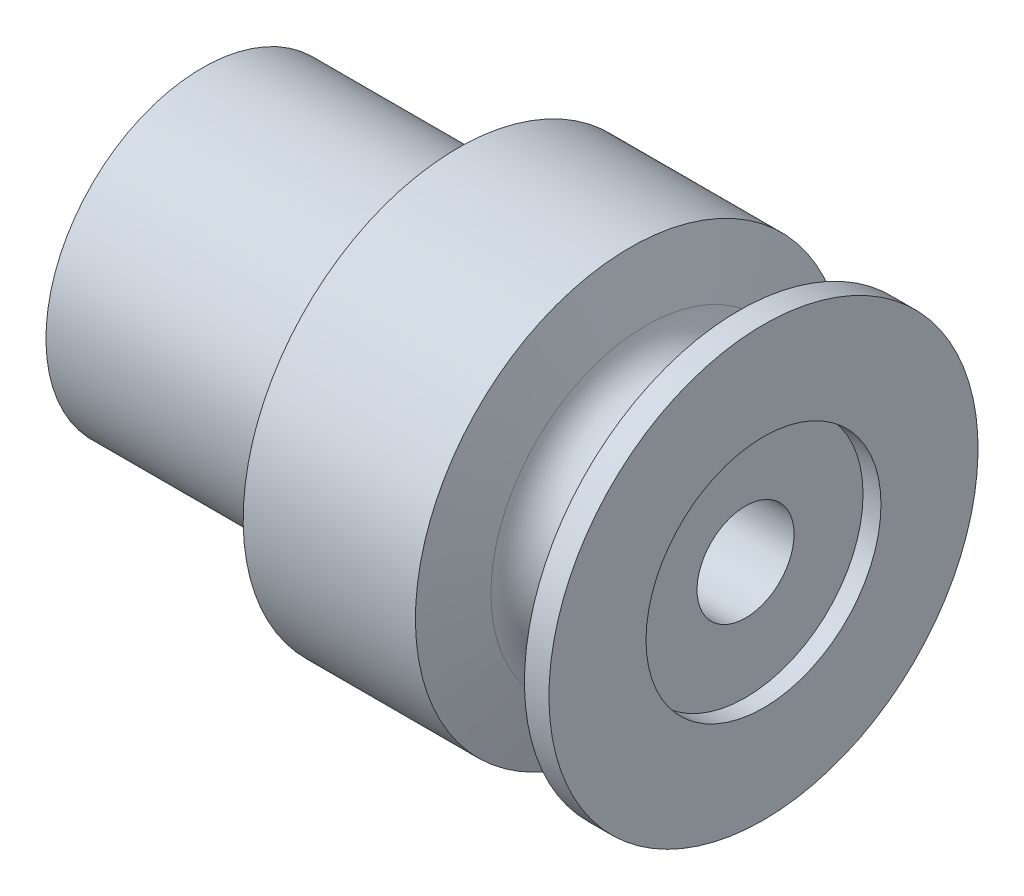
ISO-10303-21;
HEADER;
FILE_DESCRIPTION(('STEP AP214'),'2;1');
FILE_NAME('part.step','',(''),(''),'','','');
FILE_SCHEMA(('AUTOMOTIVE_DESIGN { 1 0 10303 214 1 1 1 1 }'));
ENDSEC;
DATA;
#1=APPLICATION_CONTEXT('core data for automotive mechanical design processes');
#2=APPLICATION_PROTOCOL_DEFINITION('international standard','automotive_design',2000,#1);
#3=PRODUCT_CONTEXT('',#1,'mechanical');
#4=PRODUCT('Part','Part','',(#3));
#5=PRODUCT_RELATED_PRODUCT_CATEGORY('part','',(#4));
#6=PRODUCT_DEFINITION_FORMATION('','',#4);
#7=PRODUCT_DEFINITION_CONTEXT('part definition',#1,'design');
#8=PRODUCT_DEFINITION('design','',#6,#7);
#9=PRODUCT_DEFINITION_SHAPE('','',#8);
#10=(LENGTH_UNIT() NAMED_UNIT(*) SI_UNIT(.MILLI.,.METRE.));
#11=(NAMED_UNIT(*) PLANE_ANGLE_UNIT() SI_UNIT($,.RADIAN.));
#12=(NAMED_UNIT(*) SI_UNIT($,.STERADIAN.) SOLID_ANGLE_UNIT());
#13=UNCERTAINTY_MEASURE_WITH_UNIT(LENGTH_MEASURE(1.E-05),#10,'distance_accuracy_value','');
#14=(GEOMETRIC_REPRESENTATION_CONTEXT(3) GLOBAL_UNCERTAINTY_ASSIGNED_CONTEXT((#13)) GLOBAL_UNIT_ASSIGNED_CONTEXT((#10,
#11,#12)) REPRESENTATION_CONTEXT('',''));
#15=CARTESIAN_POINT('',(0.,0.,0.));
#16=DIRECTION('',(0.,0.,1.));
#17=DIRECTION('',(1.,0.,0.));
#18=AXIS2_PLACEMENT_3D('',#15,#16,#17);
#19=CARTESIAN_POINT('',(-4.43602977043445,0.,0.));
#20=DIRECTION('',(-1.,0.,0.));
#21=DIRECTION('',(0.,-1.,0.));
#22=AXIS2_PLACEMENT_3D('',#19,#20,#21);
#23=TOROIDAL_SURFACE('',#22,8.22007499999999,1.984375);
#24=CARTESIAN_POINT('',(-6.35278883197681,0.,0.));
#25=DIRECTION('',(-1.,0.,0.));
#26=DIRECTION('',(0.,-1.,0.));
#27=AXIS2_PLACEMENT_3D('',#24,#25,#26);
#28=CIRCLE('',#27,7.70648095737467);
#29=CARTESIAN_POINT('',(-6.35278883197681,-7.70648095737467,0.));
#30=VERTEX_POINT('',#29);
#31=EDGE_CURVE('E10',#30,#30,#28,.T.);
#32=ORIENTED_EDGE('',*,*,#31,.F.);
#33=EDGE_LOOP('',(#32));
#34=FACE_BOUND('',#33,.T.);
#35=CARTESIAN_POINT('',(-2.51927070889208,0.,0.));
#36=DIRECTION('',(-1.,0.,0.));
#37=DIRECTION('',(0.,-1.,0.));
#38=AXIS2_PLACEMENT_3D('',#35,#36,#37);
#39=CIRCLE('',#38,7.70648095737466);
#40=CARTESIAN_POINT('',(-2.51927070889208,-7.70648095737466,0.));
#41=VERTEX_POINT('',#40);
#42=EDGE_CURVE('E74',#41,#41,#39,.T.);
#43=ORIENTED_EDGE('',*,*,#42,.T.);
#44=EDGE_LOOP('',(#43));
#45=FACE_BOUND('',#44,.T.);
#46=ADVANCED_FACE('F31',(#34,#45),#23,.F.);
#47=CARTESIAN_POINT('',(-6.35278883197681,0.,0.));
#48=DIRECTION('',(-1.,0.,0.));
#49=DIRECTION('',(0.,-1.,0.));
#50=AXIS2_PLACEMENT_3D('',#47,#48,#49);
#51=CONICAL_SURFACE('',#50,7.70648095737467,1.30899693899575);
#52=CARTESIAN_POINT('',(-7.14632546781767,0.,0.));
#53=DIRECTION('',(-1.,0.,0.));
#54=DIRECTION('',(0.,-1.,0.));
#55=AXIS2_PLACEMENT_3D('',#52,#53,#54);
#56=CIRCLE('',#55,10.668);
#57=CARTESIAN_POINT('',(-7.14632546781767,-10.668,0.));
#58=VERTEX_POINT('',#57);
#59=EDGE_CURVE('E37',#58,#58,#56,.T.);
#60=ORIENTED_EDGE('',*,*,#59,.F.);
#61=EDGE_LOOP('',(#60));
#62=FACE_BOUND('',#61,.T.);
#63=ORIENTED_EDGE('',*,*,#31,.T.);
#64=EDGE_LOOP('',(#63));
#65=FACE_BOUND('',#64,.T.);
#66=ADVANCED_FACE('F141',(#62,#65),#51,.T.);
#67=CARTESIAN_POINT('',(-22.598839252879,0.,0.));
#68=DIRECTION('',(-1.,0.,0.));
#69=DIRECTION('',(0.,-1.,0.));
#70=AXIS2_PLACEMENT_3D('',#67,#68,#69);
#71=CYLINDRICAL_SURFACE('',#70,10.668);
#72=CARTESIAN_POINT('',(-15.7121190817378,0.,0.));
#73=DIRECTION('',(-1.,0.,0.));
#74=DIRECTION('',(0.,-1.,0.));
#75=AXIS2_PLACEMENT_3D('',#72,#73,#74);
#76=CIRCLE('',#75,10.668);
#77=CARTESIAN_POINT('',(-15.7121190817378,-10.668,0.));
#78=VERTEX_POINT('',#77);
#79=EDGE_CURVE('E41',#78,#78,#76,.T.);
#80=ORIENTED_EDGE('',*,*,#79,.F.);
#81=EDGE_LOOP('',(#80));
#82=FACE_BOUND('',#81,.T.);
#83=ORIENTED_EDGE('',*,*,#59,.T.);
#84=EDGE_LOOP('',(#83));
#85=FACE_BOUND('',#84,.T.);
#86=ADVANCED_FACE('F136',(#82,#85),#71,.T.);
#87=CARTESIAN_POINT('',(-15.7121190817378,7.7724,0.));
#88=DIRECTION('',(1.,0.,0.));
#89=DIRECTION('',(0.,1.,0.));
#90=AXIS2_PLACEMENT_3D('',#87,#88,#89);
#91=PLANE('',#90);
#92=CARTESIAN_POINT('',(-15.7121190817378,0.,0.));
#93=DIRECTION('',(-1.,0.,0.));
#94=DIRECTION('',(0.,-1.,0.));
#95=AXIS2_PLACEMENT_3D('',#92,#93,#94);
#96=CIRCLE('',#95,7.7724);
#97=CARTESIAN_POINT('',(-15.7121190817378,-7.7724,0.));
#98=VERTEX_POINT('',#97);
#99=EDGE_CURVE('E45',#98,#98,#96,.T.);
#100=ORIENTED_EDGE('',*,*,#99,.F.);
#101=EDGE_LOOP('',(#100));
#102=FACE_BOUND('',#101,.T.);
#103=ORIENTED_EDGE('',*,*,#79,.T.);
#104=EDGE_LOOP('',(#103));
#105=FACE_BOUND('',#104,.T.);
#106=ADVANCED_FACE('F130',(#102,#105),#91,.F.);
#107=CARTESIAN_POINT('',(-22.598839252879,0.,0.));
#108=DIRECTION('',(-1.,0.,0.));
#109=DIRECTION('',(0.,-1.,0.));
#110=AXIS2_PLACEMENT_3D('',#107,#108,#109);
#111=CYLINDRICAL_SURFACE('',#110,7.7724);
#112=CARTESIAN_POINT('',(-28.4121190817378,0.,0.));
#113=DIRECTION('',(-1.,0.,0.));
#114=DIRECTION('',(0.,-1.,0.));
#115=AXIS2_PLACEMENT_3D('',#112,#113,#114);
#116=CIRCLE('',#115,7.7724);
#117=CARTESIAN_POINT('',(-28.4121190817378,-7.7724,0.));
#118=VERTEX_POINT('',#117);
#119=EDGE_CURVE('E50',#118,#118,#116,.T.);
#120=ORIENTED_EDGE('',*,*,#119,.F.);
#121=EDGE_LOOP('',(#120));
#122=FACE_BOUND('',#121,.T.);
#123=ORIENTED_EDGE('',*,*,#99,.T.);
#124=EDGE_LOOP('',(#123));
#125=FACE_BOUND('',#124,.T.);
#126=ADVANCED_FACE('F124',(#122,#125),#111,.T.);
#127=CARTESIAN_POINT('',(-28.4121190817378,7.7724,0.));
#128=DIRECTION('',(1.,0.,0.));
#129=DIRECTION('',(0.,1.,0.));
#130=AXIS2_PLACEMENT_3D('',#127,#128,#129);
#131=PLANE('',#130);
#132=CARTESIAN_POINT('',(-28.4121190817378,0.,0.));
#133=DIRECTION('',(-1.,0.,0.));
#134=DIRECTION('',(0.,-1.,0.));
#135=AXIS2_PLACEMENT_3D('',#132,#133,#134);
#136=CIRCLE('',#135,6.7564);
#137=CARTESIAN_POINT('',(-28.4121190817378,-6.7564,0.));
#138=VERTEX_POINT('',#137);
#139=EDGE_CURVE('E53',#138,#138,#136,.T.);
#140=ORIENTED_EDGE('',*,*,#139,.F.);
#141=EDGE_LOOP('',(#140));
#142=FACE_BOUND('',#141,.T.);
#143=ORIENTED_EDGE('',*,*,#119,.T.);
#144=EDGE_LOOP('',(#143));
#145=FACE_BOUND('',#144,.T.);
#146=ADVANCED_FACE('F118',(#142,#145),#131,.F.);
#147=CARTESIAN_POINT('',(-28.4121190817378,0.,0.));
#148=DIRECTION('',(-1.,0.,0.));
#149=DIRECTION('',(0.,-1.,0.));
#150=AXIS2_PLACEMENT_3D('',#147,#148,#149);
#151=CONICAL_SURFACE('',#150,6.7564,0.78539816339745);
#152=CARTESIAN_POINT('',(-24.0687190817378,0.,0.));
#153=DIRECTION('',(-1.,0.,0.));
#154=DIRECTION('',(0.,-1.,0.));
#155=AXIS2_PLACEMENT_3D('',#152,#153,#154);
#156=CIRCLE('',#155,2.413);
#157=CARTESIAN_POINT('',(-24.0687190817378,-2.413,0.));
#158=VERTEX_POINT('',#157);
#159=EDGE_CURVE('E56',#158,#158,#156,.T.);
#160=ORIENTED_EDGE('',*,*,#159,.F.);
#161=EDGE_LOOP('',(#160));
#162=FACE_BOUND('',#161,.T.);
#163=ORIENTED_EDGE('',*,*,#139,.T.);
#164=EDGE_LOOP('',(#163));
#165=FACE_BOUND('',#164,.T.);
#166=ADVANCED_FACE('F112',(#162,#165),#151,.F.);
#167=CARTESIAN_POINT('',(-22.598839252879,0.,0.));
#168=DIRECTION('',(-1.,0.,0.));
#169=DIRECTION('',(0.,-1.,0.));
#170=AXIS2_PLACEMENT_3D('',#167,#168,#169);
#171=CYLINDRICAL_SURFACE('',#170,2.413);
#172=CARTESIAN_POINT('',(-1.4,0.,0.));
#173=DIRECTION('',(-1.,0.,0.));
#174=DIRECTION('',(0.,-1.,0.));
#175=AXIS2_PLACEMENT_3D('',#172,#173,#174);
#176=CIRCLE('',#175,2.413);
#177=CARTESIAN_POINT('',(-1.4,-2.41299999999999,0.));
#178=VERTEX_POINT('',#177);
#179=EDGE_CURVE('E59',#178,#178,#176,.T.);
#180=ORIENTED_EDGE('',*,*,#179,.F.);
#181=EDGE_LOOP('',(#180));
#182=FACE_BOUND('',#181,.T.);
#183=ORIENTED_EDGE('',*,*,#159,.T.);
#184=EDGE_LOOP('',(#183));
#185=FACE_BOUND('',#184,.T.);
#186=ADVANCED_FACE('F106',(#182,#185),#171,.F.);
#187=CARTESIAN_POINT('',(-1.4,2.413,0.));
#188=DIRECTION('',(-1.,0.,0.));
#189=DIRECTION('',(0.,-1.,0.));
#190=AXIS2_PLACEMENT_3D('',#187,#188,#189);
#191=PLANE('',#190);
#192=CARTESIAN_POINT('',(-1.4,0.,0.));
#193=DIRECTION('',(-1.,0.,0.));
#194=DIRECTION('',(0.,-1.,0.));
#195=AXIS2_PLACEMENT_3D('',#192,#193,#194);
#196=CIRCLE('',#195,5.842);
#197=CARTESIAN_POINT('',(-1.4,-5.842,0.));
#198=VERTEX_POINT('',#197);
#199=EDGE_CURVE('E62',#198,#198,#196,.T.);
#200=ORIENTED_EDGE('',*,*,#199,.F.);
#201=EDGE_LOOP('',(#200));
#202=FACE_BOUND('',#201,.T.);
#203=ORIENTED_EDGE('',*,*,#179,.T.);
#204=EDGE_LOOP('',(#203));
#205=FACE_BOUND('',#204,.T.);
#206=ADVANCED_FACE('F100',(#202,#205),#191,.F.);
#207=CARTESIAN_POINT('',(-22.598839252879,0.,0.));
#208=DIRECTION('',(-1.,0.,0.));
#209=DIRECTION('',(0.,-1.,0.));
#210=AXIS2_PLACEMENT_3D('',#207,#208,#209);
#211=CYLINDRICAL_SURFACE('',#210,5.842);
#212=CARTESIAN_POINT('',(-0.507999999999998,0.,0.));
#213=DIRECTION('',(-1.,0.,0.));
#214=DIRECTION('',(0.,-1.,0.));
#215=AXIS2_PLACEMENT_3D('',#212,#213,#214);
#216=CIRCLE('',#215,5.842);
#217=CARTESIAN_POINT('',(-0.507999999999997,-5.842,0.));
#218=VERTEX_POINT('',#217);
#219=EDGE_CURVE('E65',#218,#218,#216,.T.);
#220=ORIENTED_EDGE('',*,*,#219,.F.);
#221=EDGE_LOOP('',(#220));
#222=FACE_BOUND('',#221,.T.);
#223=ORIENTED_EDGE('',*,*,#199,.T.);
#224=EDGE_LOOP('',(#223));
#225=FACE_BOUND('',#224,.T.);
#226=ADVANCED_FACE('F94',(#222,#225),#211,.F.);
#227=CARTESIAN_POINT('',(-0.508,10.668,0.));
#228=DIRECTION('',(-1.,0.,0.));
#229=DIRECTION('',(0.,-1.,0.));
#230=AXIS2_PLACEMENT_3D('',#227,#228,#229);
#231=PLANE('',#230);
#232=CARTESIAN_POINT('',(-0.508000000000002,0.,0.));
#233=DIRECTION('',(-1.,0.,0.));
#234=DIRECTION('',(0.,-1.,0.));
#235=AXIS2_PLACEMENT_3D('',#232,#233,#234);
#236=CIRCLE('',#235,10.668);
#237=CARTESIAN_POINT('',(-0.508,-10.668,0.));
#238=VERTEX_POINT('',#237);
#239=EDGE_CURVE('E68',#238,#238,#236,.T.);
#240=ORIENTED_EDGE('',*,*,#239,.F.);
#241=EDGE_LOOP('',(#240));
#242=FACE_BOUND('',#241,.T.);
#243=ORIENTED_EDGE('',*,*,#219,.T.);
#244=EDGE_LOOP('',(#243));
#245=FACE_BOUND('',#244,.T.);
#246=ADVANCED_FACE('F88',(#242,#245),#231,.F.);
#247=CARTESIAN_POINT('',(-22.598839252879,0.,0.));
#248=DIRECTION('',(-1.,0.,0.));
#249=DIRECTION('',(0.,-1.,0.));
#250=AXIS2_PLACEMENT_3D('',#247,#248,#249);
#251=CYLINDRICAL_SURFACE('',#250,10.668);
#252=CARTESIAN_POINT('',(-1.72573407305122,0.,0.));
#253=DIRECTION('',(-1.,0.,0.));
#254=DIRECTION('',(0.,-1.,0.));
#255=AXIS2_PLACEMENT_3D('',#252,#253,#254);
#256=CIRCLE('',#255,10.668);
#257=CARTESIAN_POINT('',(-1.72573407305122,-10.668,0.));
#258=VERTEX_POINT('',#257);
#259=EDGE_CURVE('E71',#258,#258,#256,.T.);
#260=ORIENTED_EDGE('',*,*,#259,.F.);
#261=EDGE_LOOP('',(#260));
#262=FACE_BOUND('',#261,.T.);
#263=ORIENTED_EDGE('',*,*,#239,.T.);
#264=EDGE_LOOP('',(#263));
#265=FACE_BOUND('',#264,.T.);
#266=ADVANCED_FACE('F82',(#262,#265),#251,.T.);
#267=CARTESIAN_POINT('',(-1.72573407305122,0.,0.));
#268=DIRECTION('',(1.,0.,0.));
#269=DIRECTION('',(0.,1.,0.));
#270=AXIS2_PLACEMENT_3D('',#267,#268,#269);
#271=CONICAL_SURFACE('',#270,10.668,1.30899693899574);
#272=ORIENTED_EDGE('',*,*,#42,.F.);
#273=EDGE_LOOP('',(#272));
#274=FACE_BOUND('',#273,.T.);
#275=ORIENTED_EDGE('',*,*,#259,.T.);
#276=EDGE_LOOP('',(#275));
#277=FACE_BOUND('',#276,.T.);
#278=ADVANCED_FACE('F79',(#274,#277),#271,.T.);
#279=CLOSED_SHELL('',(#46,#66,#86,#106,#126,#146,#166,#186,#206,#226,#246,#266,#278));
#280=MANIFOLD_SOLID_BREP('B2',#279);
#281=ADVANCED_BREP_SHAPE_REPRESENTATION('',(#18,#280),#14);
#282=SHAPE_DEFINITION_REPRESENTATION(#9,#281);
ENDSEC;
END-ISO-10303-21;
